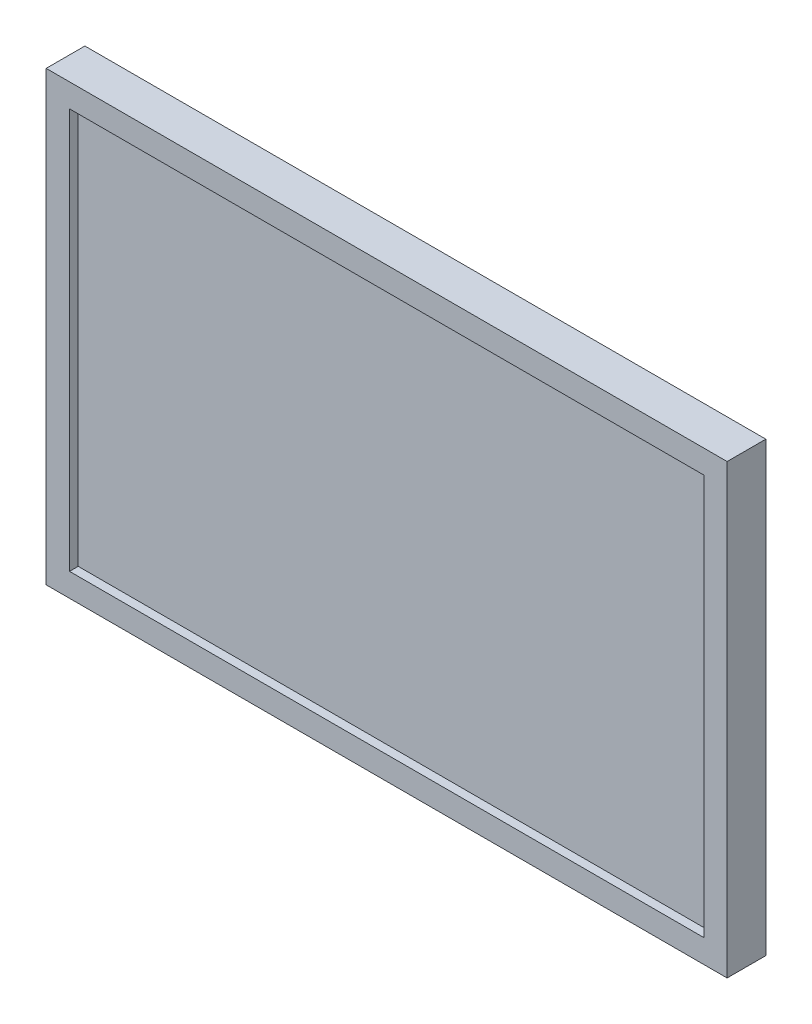
ISO-10303-21;
HEADER;
FILE_DESCRIPTION(('STEP AP214'),'2;1');
FILE_NAME('part.step','',(''),(''),'','','');
FILE_SCHEMA(('AUTOMOTIVE_DESIGN { 1 0 10303 214 1 1 1 1 }'));
ENDSEC;
DATA;
#1=APPLICATION_CONTEXT('core data for automotive mechanical design processes');
#2=APPLICATION_PROTOCOL_DEFINITION('international standard','automotive_design',2000,#1);
#3=PRODUCT_CONTEXT('',#1,'mechanical');
#4=PRODUCT('Part','Part','',(#3));
#5=PRODUCT_RELATED_PRODUCT_CATEGORY('part','',(#4));
#6=PRODUCT_DEFINITION_FORMATION('','',#4);
#7=PRODUCT_DEFINITION_CONTEXT('part definition',#1,'design');
#8=PRODUCT_DEFINITION('design','',#6,#7);
#9=PRODUCT_DEFINITION_SHAPE('','',#8);
#10=(LENGTH_UNIT() NAMED_UNIT(*) SI_UNIT(.MILLI.,.METRE.));
#11=(NAMED_UNIT(*) PLANE_ANGLE_UNIT() SI_UNIT($,.RADIAN.));
#12=(NAMED_UNIT(*) SI_UNIT($,.STERADIAN.) SOLID_ANGLE_UNIT());
#13=UNCERTAINTY_MEASURE_WITH_UNIT(LENGTH_MEASURE(1.E-05),#10,'distance_accuracy_value','');
#14=(GEOMETRIC_REPRESENTATION_CONTEXT(3) GLOBAL_UNCERTAINTY_ASSIGNED_CONTEXT((#13)) GLOBAL_UNIT_ASSIGNED_CONTEXT((#10,
#11,#12)) REPRESENTATION_CONTEXT('',''));
#15=CARTESIAN_POINT('',(0.,0.,0.));
#16=DIRECTION('',(0.,0.,1.));
#17=DIRECTION('',(1.,0.,0.));
#18=AXIS2_PLACEMENT_3D('',#15,#16,#17);
#19=CARTESIAN_POINT('',(0.,0.,-29.));
#20=DIRECTION('',(0.,0.,-1.));
#21=DIRECTION('',(-1.,0.,0.));
#22=AXIS2_PLACEMENT_3D('',#19,#20,#21);
#23=PLANE('',#22);
#24=DIRECTION('',(-1.,0.,0.));
#25=VECTOR('',#24,1.);
#26=CARTESIAN_POINT('',(125.,80.5,-29.));
#27=LINE('',#26,#25);
#28=CARTESIAN_POINT('',(125.,80.5,-29.));
#29=VERTEX_POINT('',#28);
#30=CARTESIAN_POINT('',(-125.,80.5,-29.));
#31=VERTEX_POINT('',#30);
#32=EDGE_CURVE('E229',#29,#31,#27,.T.);
#33=ORIENTED_EDGE('',*,*,#32,.T.);
#34=DIRECTION('',(0.831065477040289,-0.556174588480809,0.));
#35=VECTOR('',#34,1.);
#36=CARTESIAN_POINT('',(-125.,80.5,-29.));
#37=LINE('',#36,#35);
#38=CARTESIAN_POINT('',(-255.,167.5,-29.));
#39=VERTEX_POINT('',#38);
#40=EDGE_CURVE('E293',#39,#31,#37,.T.);
#41=ORIENTED_EDGE('',*,*,#40,.F.);
#42=DIRECTION('',(-1.,0.,0.));
#43=VECTOR('',#42,1.);
#44=CARTESIAN_POINT('',(-255.,167.5,-29.));
#45=LINE('',#44,#43);
#46=CARTESIAN_POINT('',(255.,167.5,-29.));
#47=VERTEX_POINT('',#46);
#48=EDGE_CURVE('E117',#47,#39,#45,.T.);
#49=ORIENTED_EDGE('',*,*,#48,.F.);
#50=DIRECTION('',(-0.831065477040289,-0.556174588480809,0.));
#51=VECTOR('',#50,1.);
#52=CARTESIAN_POINT('',(125.,80.5,-29.));
#53=LINE('',#52,#51);
#54=EDGE_CURVE('E66',#47,#29,#53,.T.);
#55=ORIENTED_EDGE('',*,*,#54,.T.);
#56=EDGE_LOOP('',(#33,#41,#49,#55));
#57=FACE_BOUND('',#56,.T.);
#58=ADVANCED_FACE('F39',(#57),#23,.T.);
#59=CARTESIAN_POINT('',(125.,80.5,264.625611961899));
#60=DIRECTION('',(0.,1.,0.));
#61=DIRECTION('',(-1.,0.,0.));
#62=AXIS2_PLACEMENT_3D('',#59,#60,#61);
#63=PLANE('',#62);
#64=DIRECTION('',(0.,0.,-1.));
#65=VECTOR('',#64,1.);
#66=CARTESIAN_POINT('',(125.,80.5,240.432737431812));
#67=LINE('',#66,#65);
#68=CARTESIAN_POINT('',(125.,80.5,-92.));
#69=VERTEX_POINT('',#68);
#70=EDGE_CURVE('E307',#29,#69,#67,.T.);
#71=ORIENTED_EDGE('',*,*,#70,.T.);
#72=DIRECTION('',(1.,0.,0.));
#73=VECTOR('',#72,1.);
#74=CARTESIAN_POINT('',(125.,80.5,-92.));
#75=LINE('',#74,#73);
#76=CARTESIAN_POINT('',(-125.,80.5,-92.));
#77=VERTEX_POINT('',#76);
#78=EDGE_CURVE('E257',#77,#69,#75,.T.);
#79=ORIENTED_EDGE('',*,*,#78,.F.);
#80=DIRECTION('',(0.,0.,-1.));
#81=VECTOR('',#80,1.);
#82=CARTESIAN_POINT('',(-125.,80.5,240.432737431812));
#83=LINE('',#82,#81);
#84=EDGE_CURVE('E297',#31,#77,#83,.T.);
#85=ORIENTED_EDGE('',*,*,#84,.F.);
#86=ORIENTED_EDGE('',*,*,#32,.F.);
#87=EDGE_LOOP('',(#71,#79,#85,#86));
#88=FACE_BOUND('',#87,.T.);
#89=ADVANCED_FACE('F412',(#88),#63,.T.);
#90=CARTESIAN_POINT('',(255.,-167.5,-29.));
#91=DIRECTION('',(1.,0.,0.));
#92=DIRECTION('',(0.,0.,-1.));
#93=AXIS2_PLACEMENT_3D('',#90,#91,#92);
#94=PLANE('',#93);
#95=DIRECTION('',(0.,1.,0.));
#96=VECTOR('',#95,1.);
#97=CARTESIAN_POINT('',(255.,-167.5,0.));
#98=LINE('',#97,#96);
#99=CARTESIAN_POINT('',(255.,-167.5,0.));
#100=VERTEX_POINT('',#99);
#101=CARTESIAN_POINT('',(255.,167.5,0.));
#102=VERTEX_POINT('',#101);
#103=EDGE_CURVE('E134',#100,#102,#98,.T.);
#104=ORIENTED_EDGE('',*,*,#103,.F.);
#105=DIRECTION('',(0.,0.,1.));
#106=VECTOR('',#105,1.);
#107=CARTESIAN_POINT('',(255.,-167.5,-29.));
#108=LINE('',#107,#106);
#109=CARTESIAN_POINT('',(255.,-167.5,-29.));
#110=VERTEX_POINT('',#109);
#111=EDGE_CURVE('E11',#110,#100,#108,.T.);
#112=ORIENTED_EDGE('',*,*,#111,.F.);
#113=DIRECTION('',(0.,1.,0.));
#114=VECTOR('',#113,1.);
#115=CARTESIAN_POINT('',(255.,-167.5,-29.));
#116=LINE('',#115,#114);
#117=EDGE_CURVE('E113',#110,#47,#116,.T.);
#118=ORIENTED_EDGE('',*,*,#117,.T.);
#119=DIRECTION('',(0.,0.,1.));
#120=VECTOR('',#119,1.);
#121=CARTESIAN_POINT('',(255.,167.5,-29.));
#122=LINE('',#121,#120);
#123=EDGE_CURVE('E43',#47,#102,#122,.T.);
#124=ORIENTED_EDGE('',*,*,#123,.T.);
#125=EDGE_LOOP('',(#104,#112,#118,#124));
#126=FACE_BOUND('',#125,.T.);
#127=ADVANCED_FACE('F41',(#126),#94,.T.);
#128=CARTESIAN_POINT('',(-255.,-167.5,-29.));
#129=DIRECTION('',(0.,-1.,0.));
#130=DIRECTION('',(0.,0.,-1.));
#131=AXIS2_PLACEMENT_3D('',#128,#129,#130);
#132=PLANE('',#131);
#133=DIRECTION('',(1.,0.,0.));
#134=VECTOR('',#133,1.);
#135=CARTESIAN_POINT('',(-255.,-167.5,0.));
#136=LINE('',#135,#134);
#137=CARTESIAN_POINT('',(-255.,-167.5,0.));
#138=VERTEX_POINT('',#137);
#139=EDGE_CURVE('E104',#138,#100,#136,.T.);
#140=ORIENTED_EDGE('',*,*,#139,.F.);
#141=DIRECTION('',(0.,0.,1.));
#142=VECTOR('',#141,1.);
#143=CARTESIAN_POINT('',(-255.,-167.5,-29.));
#144=LINE('',#143,#142);
#145=CARTESIAN_POINT('',(-255.,-167.5,-29.));
#146=VERTEX_POINT('',#145);
#147=EDGE_CURVE('E49',#146,#138,#144,.T.);
#148=ORIENTED_EDGE('',*,*,#147,.F.);
#149=DIRECTION('',(1.,0.,0.));
#150=VECTOR('',#149,1.);
#151=CARTESIAN_POINT('',(-255.,-167.5,-29.));
#152=LINE('',#151,#150);
#153=EDGE_CURVE('E124',#146,#110,#152,.T.);
#154=ORIENTED_EDGE('',*,*,#153,.T.);
#155=ORIENTED_EDGE('',*,*,#111,.T.);
#156=EDGE_LOOP('',(#140,#148,#154,#155));
#157=FACE_BOUND('',#156,.T.);
#158=ADVANCED_FACE('F109',(#157),#132,.T.);
#159=CARTESIAN_POINT('',(-255.,-167.5,-29.));
#160=DIRECTION('',(-1.,0.,0.));
#161=DIRECTION('',(0.,0.,1.));
#162=AXIS2_PLACEMENT_3D('',#159,#160,#161);
#163=PLANE('',#162);
#164=DIRECTION('',(0.,-1.,0.));
#165=VECTOR('',#164,1.);
#166=CARTESIAN_POINT('',(-255.,-167.5,0.));
#167=LINE('',#166,#165);
#168=CARTESIAN_POINT('',(-255.,167.5,0.));
#169=VERTEX_POINT('',#168);
#170=EDGE_CURVE('E88',#169,#138,#167,.T.);
#171=ORIENTED_EDGE('',*,*,#170,.F.);
#172=DIRECTION('',(0.,0.,1.));
#173=VECTOR('',#172,1.);
#174=CARTESIAN_POINT('',(-255.,167.5,-29.));
#175=LINE('',#174,#173);
#176=EDGE_CURVE('E98',#39,#169,#175,.T.);
#177=ORIENTED_EDGE('',*,*,#176,.F.);
#178=DIRECTION('',(0.,-1.,0.));
#179=VECTOR('',#178,1.);
#180=CARTESIAN_POINT('',(-255.,-167.5,-29.));
#181=LINE('',#180,#179);
#182=EDGE_CURVE('E92',#39,#146,#181,.T.);
#183=ORIENTED_EDGE('',*,*,#182,.T.);
#184=ORIENTED_EDGE('',*,*,#147,.T.);
#185=EDGE_LOOP('',(#171,#177,#183,#184));
#186=FACE_BOUND('',#185,.T.);
#187=ADVANCED_FACE('F86',(#186),#163,.T.);
#188=CARTESIAN_POINT('',(-255.,167.5,-29.));
#189=DIRECTION('',(0.,1.,0.));
#190=DIRECTION('',(0.,0.,1.));
#191=AXIS2_PLACEMENT_3D('',#188,#189,#190);
#192=PLANE('',#191);
#193=DIRECTION('',(-1.,0.,0.));
#194=VECTOR('',#193,1.);
#195=CARTESIAN_POINT('',(-255.,167.5,0.));
#196=LINE('',#195,#194);
#197=EDGE_CURVE('E106',#102,#169,#196,.T.);
#198=ORIENTED_EDGE('',*,*,#197,.F.);
#199=ORIENTED_EDGE('',*,*,#123,.F.);
#200=ORIENTED_EDGE('',*,*,#48,.T.);
#201=ORIENTED_EDGE('',*,*,#176,.T.);
#202=EDGE_LOOP('',(#198,#199,#200,#201));
#203=FACE_BOUND('',#202,.T.);
#204=ADVANCED_FACE('F319',(#203),#192,.T.);
#205=CARTESIAN_POINT('',(0.,0.,0.));
#206=DIRECTION('',(0.,0.,-1.));
#207=DIRECTION('',(-1.,0.,0.));
#208=AXIS2_PLACEMENT_3D('',#205,#206,#207);
#209=PLANE('',#208);
#210=DIRECTION('',(1.,0.,0.));
#211=VECTOR('',#210,1.);
#212=CARTESIAN_POINT('',(237.5,-150.,0.));
#213=LINE('',#212,#211);
#214=CARTESIAN_POINT('',(-237.5,-150.,0.));
#215=VERTEX_POINT('',#214);
#216=CARTESIAN_POINT('',(237.5,-150.,0.));
#217=VERTEX_POINT('',#216);
#218=EDGE_CURVE('E175',#215,#217,#213,.T.);
#219=ORIENTED_EDGE('',*,*,#218,.F.);
#220=DIRECTION('',(0.,-1.,0.));
#221=VECTOR('',#220,1.);
#222=CARTESIAN_POINT('',(-237.5,-150.,0.));
#223=LINE('',#222,#221);
#224=CARTESIAN_POINT('',(-237.5,150.,0.));
#225=VERTEX_POINT('',#224);
#226=EDGE_CURVE('E57',#225,#215,#223,.T.);
#227=ORIENTED_EDGE('',*,*,#226,.F.);
#228=DIRECTION('',(-1.,0.,0.));
#229=VECTOR('',#228,1.);
#230=CARTESIAN_POINT('',(237.5,150.,0.));
#231=LINE('',#230,#229);
#232=CARTESIAN_POINT('',(237.5,150.,0.));
#233=VERTEX_POINT('',#232);
#234=EDGE_CURVE('E167',#233,#225,#231,.T.);
#235=ORIENTED_EDGE('',*,*,#234,.F.);
#236=DIRECTION('',(0.,1.,0.));
#237=VECTOR('',#236,1.);
#238=CARTESIAN_POINT('',(237.5,-150.,0.));
#239=LINE('',#238,#237);
#240=EDGE_CURVE('E171',#217,#233,#239,.T.);
#241=ORIENTED_EDGE('',*,*,#240,.F.);
#242=EDGE_LOOP('',(#219,#227,#235,#241));
#243=FACE_BOUND('',#242,.T.);
#244=ORIENTED_EDGE('',*,*,#103,.T.);
#245=ORIENTED_EDGE('',*,*,#197,.T.);
#246=ORIENTED_EDGE('',*,*,#170,.T.);
#247=ORIENTED_EDGE('',*,*,#139,.T.);
#248=EDGE_LOOP('',(#244,#245,#246,#247));
#249=FACE_BOUND('',#248,.T.);
#250=ADVANCED_FACE('F103',(#243,#249),#209,.F.);
#251=CARTESIAN_POINT('',(-237.5,-150.,-6.5));
#252=DIRECTION('',(-1.,0.,0.));
#253=DIRECTION('',(0.,0.,1.));
#254=AXIS2_PLACEMENT_3D('',#251,#252,#253);
#255=PLANE('',#254);
#256=ORIENTED_EDGE('',*,*,#226,.T.);
#257=DIRECTION('',(0.,0.,1.));
#258=VECTOR('',#257,1.);
#259=CARTESIAN_POINT('',(-237.5,-150.,-6.5));
#260=LINE('',#259,#258);
#261=CARTESIAN_POINT('',(-237.5,-150.,-6.5));
#262=VERTEX_POINT('',#261);
#263=EDGE_CURVE('E148',#262,#215,#260,.T.);
#264=ORIENTED_EDGE('',*,*,#263,.F.);
#265=DIRECTION('',(0.,-1.,0.));
#266=VECTOR('',#265,1.);
#267=CARTESIAN_POINT('',(-237.5,-150.,-6.5));
#268=LINE('',#267,#266);
#269=CARTESIAN_POINT('',(-237.5,150.,-6.5));
#270=VERTEX_POINT('',#269);
#271=EDGE_CURVE('E163',#270,#262,#268,.T.);
#272=ORIENTED_EDGE('',*,*,#271,.F.);
#273=DIRECTION('',(0.,0.,1.));
#274=VECTOR('',#273,1.);
#275=CARTESIAN_POINT('',(-237.5,150.,-6.5));
#276=LINE('',#275,#274);
#277=EDGE_CURVE('E136',#270,#225,#276,.T.);
#278=ORIENTED_EDGE('',*,*,#277,.T.);
#279=EDGE_LOOP('',(#256,#264,#272,#278));
#280=FACE_BOUND('',#279,.T.);
#281=ADVANCED_FACE('F389',(#280),#255,.F.);
#282=CARTESIAN_POINT('',(237.5,150.,-6.5));
#283=DIRECTION('',(0.,1.,0.));
#284=DIRECTION('',(-1.,0.,0.));
#285=AXIS2_PLACEMENT_3D('',#282,#283,#284);
#286=PLANE('',#285);
#287=ORIENTED_EDGE('',*,*,#234,.T.);
#288=ORIENTED_EDGE('',*,*,#277,.F.);
#289=DIRECTION('',(-1.,0.,0.));
#290=VECTOR('',#289,1.);
#291=CARTESIAN_POINT('',(237.5,150.,-6.5));
#292=LINE('',#291,#290);
#293=CARTESIAN_POINT('',(237.5,150.,-6.5));
#294=VERTEX_POINT('',#293);
#295=EDGE_CURVE('E151',#294,#270,#292,.T.);
#296=ORIENTED_EDGE('',*,*,#295,.F.);
#297=DIRECTION('',(0.,0.,1.));
#298=VECTOR('',#297,1.);
#299=CARTESIAN_POINT('',(237.5,150.,-6.5));
#300=LINE('',#299,#298);
#301=EDGE_CURVE('E140',#294,#233,#300,.T.);
#302=ORIENTED_EDGE('',*,*,#301,.T.);
#303=EDGE_LOOP('',(#287,#288,#296,#302));
#304=FACE_BOUND('',#303,.T.);
#305=ADVANCED_FACE('F391',(#304),#286,.F.);
#306=CARTESIAN_POINT('',(237.5,-150.,-6.5));
#307=DIRECTION('',(1.,0.,0.));
#308=DIRECTION('',(0.,0.,-1.));
#309=AXIS2_PLACEMENT_3D('',#306,#307,#308);
#310=PLANE('',#309);
#311=ORIENTED_EDGE('',*,*,#240,.T.);
#312=ORIENTED_EDGE('',*,*,#301,.F.);
#313=DIRECTION('',(0.,1.,0.));
#314=VECTOR('',#313,1.);
#315=CARTESIAN_POINT('',(237.5,-150.,-6.5));
#316=LINE('',#315,#314);
#317=CARTESIAN_POINT('',(237.5,-150.,-6.5));
#318=VERTEX_POINT('',#317);
#319=EDGE_CURVE('E155',#318,#294,#316,.T.);
#320=ORIENTED_EDGE('',*,*,#319,.F.);
#321=DIRECTION('',(0.,0.,1.));
#322=VECTOR('',#321,1.);
#323=CARTESIAN_POINT('',(237.5,-150.,-6.5));
#324=LINE('',#323,#322);
#325=EDGE_CURVE('E144',#318,#217,#324,.T.);
#326=ORIENTED_EDGE('',*,*,#325,.T.);
#327=EDGE_LOOP('',(#311,#312,#320,#326));
#328=FACE_BOUND('',#327,.T.);
#329=ADVANCED_FACE('F402',(#328),#310,.F.);
#330=CARTESIAN_POINT('',(237.5,-150.,-6.5));
#331=DIRECTION('',(0.,-1.,0.));
#332=DIRECTION('',(1.,0.,0.));
#333=AXIS2_PLACEMENT_3D('',#330,#331,#332);
#334=PLANE('',#333);
#335=ORIENTED_EDGE('',*,*,#218,.T.);
#336=ORIENTED_EDGE('',*,*,#325,.F.);
#337=DIRECTION('',(1.,0.,0.));
#338=VECTOR('',#337,1.);
#339=CARTESIAN_POINT('',(237.5,-150.,-6.5));
#340=LINE('',#339,#338);
#341=EDGE_CURVE('E159',#262,#318,#340,.T.);
#342=ORIENTED_EDGE('',*,*,#341,.F.);
#343=ORIENTED_EDGE('',*,*,#263,.T.);
#344=EDGE_LOOP('',(#335,#336,#342,#343));
#345=FACE_BOUND('',#344,.T.);
#346=ADVANCED_FACE('F396',(#345),#334,.F.);
#347=CARTESIAN_POINT('',(0.,0.,-6.5));
#348=DIRECTION('',(0.,0.,1.));
#349=DIRECTION('',(1.,0.,0.));
#350=AXIS2_PLACEMENT_3D('',#347,#348,#349);
#351=PLANE('',#350);
#352=ORIENTED_EDGE('',*,*,#271,.T.);
#353=ORIENTED_EDGE('',*,*,#341,.T.);
#354=ORIENTED_EDGE('',*,*,#319,.T.);
#355=ORIENTED_EDGE('',*,*,#295,.T.);
#356=EDGE_LOOP('',(#352,#353,#354,#355));
#357=FACE_BOUND('',#356,.T.);
#358=ADVANCED_FACE('F400',(#357),#351,.T.);
#359=CARTESIAN_POINT('',(61.,-60.4999999999999,264.625611961899));
#360=DIRECTION('',(0.,-1.,0.));
#361=DIRECTION('',(0.,0.,-1.));
#362=AXIS2_PLACEMENT_3D('',#359,#360,#361);
#363=PLANE('',#362);
#364=DIRECTION('',(0.,0.,-1.));
#365=VECTOR('',#364,1.);
#366=CARTESIAN_POINT('',(-61.,-60.4999999999999,264.625611961899));
#367=LINE('',#366,#365);
#368=CARTESIAN_POINT('',(-61.,-60.4999999999999,-85.));
#369=VERTEX_POINT('',#368);
#370=CARTESIAN_POINT('',(-61.,-60.4999999999999,-92.));
#371=VERTEX_POINT('',#370);
#372=EDGE_CURVE('E241',#369,#371,#367,.T.);
#373=ORIENTED_EDGE('',*,*,#372,.F.);
#374=DIRECTION('',(-1.,0.,0.));
#375=VECTOR('',#374,1.);
#376=CARTESIAN_POINT('',(61.,-60.4999999999999,-85.));
#377=LINE('',#376,#375);
#378=CARTESIAN_POINT('',(61.,-60.4999999999999,-85.));
#379=VERTEX_POINT('',#378);
#380=EDGE_CURVE('E181',#379,#369,#377,.T.);
#381=ORIENTED_EDGE('',*,*,#380,.F.);
#382=DIRECTION('',(0.,0.,-1.));
#383=VECTOR('',#382,1.);
#384=CARTESIAN_POINT('',(61.,-60.4999999999999,264.625611961899));
#385=LINE('',#384,#383);
#386=CARTESIAN_POINT('',(61.,-60.4999999999999,-92.));
#387=VERTEX_POINT('',#386);
#388=EDGE_CURVE('E245',#379,#387,#385,.T.);
#389=ORIENTED_EDGE('',*,*,#388,.T.);
#390=DIRECTION('',(-1.,0.,0.));
#391=VECTOR('',#390,1.);
#392=CARTESIAN_POINT('',(61.,-60.4999999999999,-92.));
#393=LINE('',#392,#391);
#394=EDGE_CURVE('E273',#387,#371,#393,.T.);
#395=ORIENTED_EDGE('',*,*,#394,.T.);
#396=EDGE_LOOP('',(#373,#381,#389,#395));
#397=FACE_BOUND('',#396,.T.);
#398=ADVANCED_FACE('F543',(#397),#363,.F.);
#399=CARTESIAN_POINT('',(-61.,-60.4999999999999,264.625611961899));
#400=DIRECTION('',(-1.,0.,0.));
#401=DIRECTION('',(0.,0.,1.));
#402=AXIS2_PLACEMENT_3D('',#399,#400,#401);
#403=PLANE('',#402);
#404=DIRECTION('',(0.,0.,-1.));
#405=VECTOR('',#404,1.);
#406=CARTESIAN_POINT('',(-61.,61.5000000000001,264.625611961899));
#407=LINE('',#406,#405);
#408=CARTESIAN_POINT('',(-61.,61.5000000000001,-85.));
#409=VERTEX_POINT('',#408);
#410=CARTESIAN_POINT('',(-61.,61.5000000000001,-92.));
#411=VERTEX_POINT('',#410);
#412=EDGE_CURVE('E237',#409,#411,#407,.T.);
#413=ORIENTED_EDGE('',*,*,#412,.F.);
#414=DIRECTION('',(0.,1.,0.));
#415=VECTOR('',#414,1.);
#416=CARTESIAN_POINT('',(-61.,-60.4999999999999,-85.));
#417=LINE('',#416,#415);
#418=EDGE_CURVE('E193',#369,#409,#417,.T.);
#419=ORIENTED_EDGE('',*,*,#418,.F.);
#420=ORIENTED_EDGE('',*,*,#372,.T.);
#421=DIRECTION('',(0.,1.,0.));
#422=VECTOR('',#421,1.);
#423=CARTESIAN_POINT('',(-61.,-60.4999999999999,-92.));
#424=LINE('',#423,#422);
#425=EDGE_CURVE('E269',#371,#411,#424,.T.);
#426=ORIENTED_EDGE('',*,*,#425,.T.);
#427=EDGE_LOOP('',(#413,#419,#420,#426));
#428=FACE_BOUND('',#427,.T.);
#429=ADVANCED_FACE('F533',(#428),#403,.F.);
#430=CARTESIAN_POINT('',(-61.,61.5000000000001,264.625611961899));
#431=DIRECTION('',(0.,1.,0.));
#432=DIRECTION('',(0.,0.,1.));
#433=AXIS2_PLACEMENT_3D('',#430,#431,#432);
#434=PLANE('',#433);
#435=DIRECTION('',(0.,0.,-1.));
#436=VECTOR('',#435,1.);
#437=CARTESIAN_POINT('',(61.0000000000001,61.5000000000001,264.625611961899));
#438=LINE('',#437,#436);
#439=CARTESIAN_POINT('',(61.0000000000001,61.5000000000001,-85.));
#440=VERTEX_POINT('',#439);
#441=CARTESIAN_POINT('',(61.0000000000001,61.5000000000001,-92.));
#442=VERTEX_POINT('',#441);
#443=EDGE_CURVE('E233',#440,#442,#438,.T.);
#444=ORIENTED_EDGE('',*,*,#443,.F.);
#445=DIRECTION('',(1.,0.,0.));
#446=VECTOR('',#445,1.);
#447=CARTESIAN_POINT('',(61.0000000000001,61.5000000000001,-85.));
#448=LINE('',#447,#446);
#449=EDGE_CURVE('E189',#409,#440,#448,.T.);
#450=ORIENTED_EDGE('',*,*,#449,.F.);
#451=ORIENTED_EDGE('',*,*,#412,.T.);
#452=DIRECTION('',(1.,0.,0.));
#453=VECTOR('',#452,1.);
#454=CARTESIAN_POINT('',(-61.,61.5000000000001,-92.));
#455=LINE('',#454,#453);
#456=EDGE_CURVE('E265',#411,#442,#455,.T.);
#457=ORIENTED_EDGE('',*,*,#456,.T.);
#458=EDGE_LOOP('',(#444,#450,#451,#457));
#459=FACE_BOUND('',#458,.T.);
#460=ADVANCED_FACE('F523',(#459),#434,.F.);
#461=CARTESIAN_POINT('',(61.0000000000001,61.5000000000001,264.625611961899));
#462=DIRECTION('',(1.,0.,0.));
#463=DIRECTION('',(0.,1.,0.));
#464=AXIS2_PLACEMENT_3D('',#461,#462,#463);
#465=PLANE('',#464);
#466=ORIENTED_EDGE('',*,*,#388,.F.);
#467=DIRECTION('',(0.,-1.,0.));
#468=VECTOR('',#467,1.);
#469=CARTESIAN_POINT('',(61.,-60.4999999999999,-85.));
#470=LINE('',#469,#468);
#471=EDGE_CURVE('E185',#440,#379,#470,.T.);
#472=ORIENTED_EDGE('',*,*,#471,.F.);
#473=ORIENTED_EDGE('',*,*,#443,.T.);
#474=DIRECTION('',(0.,-1.,0.));
#475=VECTOR('',#474,1.);
#476=CARTESIAN_POINT('',(61.0000000000001,61.5000000000001,-92.));
#477=LINE('',#476,#475);
#478=EDGE_CURVE('E277',#442,#387,#477,.T.);
#479=ORIENTED_EDGE('',*,*,#478,.T.);
#480=EDGE_LOOP('',(#466,#472,#473,#479));
#481=FACE_BOUND('',#480,.T.);
#482=ADVANCED_FACE('F440',(#481),#465,.F.);
#483=CARTESIAN_POINT('',(0.,0.,-92.));
#484=DIRECTION('',(0.,0.,1.));
#485=DIRECTION('',(1.,0.,0.));
#486=AXIS2_PLACEMENT_3D('',#483,#484,#485);
#487=PLANE('',#486);
#488=DIRECTION('',(0.,1.,0.));
#489=VECTOR('',#488,1.);
#490=CARTESIAN_POINT('',(-125.,-73.4999999999999,-92.));
#491=LINE('',#490,#489);
#492=CARTESIAN_POINT('',(-125.,-73.4999999999999,-92.));
#493=VERTEX_POINT('',#492);
#494=EDGE_CURVE('E261',#493,#77,#491,.T.);
#495=ORIENTED_EDGE('',*,*,#494,.T.);
#496=ORIENTED_EDGE('',*,*,#78,.T.);
#497=DIRECTION('',(0.,-1.,0.));
#498=VECTOR('',#497,1.);
#499=CARTESIAN_POINT('',(125.,-73.4999999999999,-92.));
#500=LINE('',#499,#498);
#501=CARTESIAN_POINT('',(125.,-73.4999999999999,-92.));
#502=VERTEX_POINT('',#501);
#503=EDGE_CURVE('E253',#69,#502,#500,.T.);
#504=ORIENTED_EDGE('',*,*,#503,.T.);
#505=DIRECTION('',(-1.,0.,0.));
#506=VECTOR('',#505,1.);
#507=CARTESIAN_POINT('',(125.,-73.4999999999999,-92.));
#508=LINE('',#507,#506);
#509=EDGE_CURVE('E249',#502,#493,#508,.T.);
#510=ORIENTED_EDGE('',*,*,#509,.T.);
#511=EDGE_LOOP('',(#495,#496,#504,#510));
#512=FACE_BOUND('',#511,.T.);
#513=ORIENTED_EDGE('',*,*,#478,.F.);
#514=ORIENTED_EDGE('',*,*,#456,.F.);
#515=ORIENTED_EDGE('',*,*,#425,.F.);
#516=ORIENTED_EDGE('',*,*,#394,.F.);
#517=EDGE_LOOP('',(#513,#514,#515,#516));
#518=FACE_BOUND('',#517,.T.);
#519=ADVANCED_FACE('F343',(#512,#518),#487,.F.);
#520=CARTESIAN_POINT('',(50.,50.,-75.));
#521=DIRECTION('',(0.,0.,-1.));
#522=DIRECTION('',(-1.,0.,0.));
#523=AXIS2_PLACEMENT_3D('',#520,#521,#522);
#524=PLANE('',#523);
#525=CARTESIAN_POINT('',(50.,50.,-75.));
#526=DIRECTION('',(0.,0.,-1.));
#527=DIRECTION('',(-1.,0.,0.));
#528=AXIS2_PLACEMENT_3D('',#525,#526,#527);
#529=CIRCLE('',#528,2.);
#530=CARTESIAN_POINT('',(48.,50.,-75.));
#531=VERTEX_POINT('',#530);
#532=EDGE_CURVE('E197',#531,#531,#529,.T.);
#533=ORIENTED_EDGE('',*,*,#532,.T.);
#534=EDGE_LOOP('',(#533));
#535=FACE_BOUND('',#534,.T.);
#536=ADVANCED_FACE('F439',(#535),#524,.T.);
#537=CARTESIAN_POINT('',(-50.,50.,-75.));
#538=DIRECTION('',(0.,0.,-1.));
#539=DIRECTION('',(-1.,0.,0.));
#540=AXIS2_PLACEMENT_3D('',#537,#538,#539);
#541=PLANE('',#540);
#542=CARTESIAN_POINT('',(-50.,50.,-75.));
#543=DIRECTION('',(0.,0.,-1.));
#544=DIRECTION('',(-1.,0.,0.));
#545=AXIS2_PLACEMENT_3D('',#542,#543,#544);
#546=CIRCLE('',#545,2.);
#547=CARTESIAN_POINT('',(-52.,50.,-75.));
#548=VERTEX_POINT('',#547);
#549=EDGE_CURVE('E205',#548,#548,#546,.T.);
#550=ORIENTED_EDGE('',*,*,#549,.T.);
#551=EDGE_LOOP('',(#550));
#552=FACE_BOUND('',#551,.T.);
#553=ADVANCED_FACE('F586',(#552),#541,.T.);
#554=CARTESIAN_POINT('',(-50.,-50.,-75.));
#555=DIRECTION('',(0.,0.,-1.));
#556=DIRECTION('',(-1.,0.,0.));
#557=AXIS2_PLACEMENT_3D('',#554,#555,#556);
#558=PLANE('',#557);
#559=CARTESIAN_POINT('',(-50.,-50.,-75.));
#560=DIRECTION('',(0.,0.,-1.));
#561=DIRECTION('',(-1.,0.,0.));
#562=AXIS2_PLACEMENT_3D('',#559,#560,#561);
#563=CIRCLE('',#562,2.);
#564=CARTESIAN_POINT('',(-52.,-50.,-75.));
#565=VERTEX_POINT('',#564);
#566=EDGE_CURVE('E213',#565,#565,#563,.T.);
#567=ORIENTED_EDGE('',*,*,#566,.T.);
#568=EDGE_LOOP('',(#567));
#569=FACE_BOUND('',#568,.T.);
#570=ADVANCED_FACE('F565',(#569),#558,.T.);
#571=CARTESIAN_POINT('',(50.,-50.,-75.));
#572=DIRECTION('',(0.,0.,-1.));
#573=DIRECTION('',(-1.,0.,0.));
#574=AXIS2_PLACEMENT_3D('',#571,#572,#573);
#575=PLANE('',#574);
#576=CARTESIAN_POINT('',(50.,-50.,-75.));
#577=DIRECTION('',(0.,0.,-1.));
#578=DIRECTION('',(-1.,0.,0.));
#579=AXIS2_PLACEMENT_3D('',#576,#577,#578);
#580=CIRCLE('',#579,2.);
#581=CARTESIAN_POINT('',(48.,-50.,-75.));
#582=VERTEX_POINT('',#581);
#583=EDGE_CURVE('E221',#582,#582,#580,.T.);
#584=ORIENTED_EDGE('',*,*,#583,.T.);
#585=EDGE_LOOP('',(#584));
#586=FACE_BOUND('',#585,.T.);
#587=ADVANCED_FACE('F560',(#586),#575,.T.);
#588=CARTESIAN_POINT('',(50.,50.,-75.));
#589=DIRECTION('',(0.,0.,-1.));
#590=DIRECTION('',(-1.,0.,0.));
#591=AXIS2_PLACEMENT_3D('',#588,#589,#590);
#592=CYLINDRICAL_SURFACE('',#591,2.);
#593=ORIENTED_EDGE('',*,*,#532,.F.);
#594=EDGE_LOOP('',(#593));
#595=FACE_BOUND('',#594,.T.);
#596=CARTESIAN_POINT('',(50.,50.,-85.));
#597=DIRECTION('',(0.,0.,-1.));
#598=DIRECTION('',(-1.,0.,0.));
#599=AXIS2_PLACEMENT_3D('',#596,#597,#598);
#600=CIRCLE('',#599,2.);
#601=CARTESIAN_POINT('',(48.,50.,-85.));
#602=VERTEX_POINT('',#601);
#603=EDGE_CURVE('E201',#602,#602,#600,.T.);
#604=ORIENTED_EDGE('',*,*,#603,.T.);
#605=EDGE_LOOP('',(#604));
#606=FACE_BOUND('',#605,.T.);
#607=ADVANCED_FACE('F564',(#595,#606),#592,.F.);
#608=CARTESIAN_POINT('',(-50.,50.,-75.));
#609=DIRECTION('',(0.,0.,-1.));
#610=DIRECTION('',(-1.,0.,0.));
#611=AXIS2_PLACEMENT_3D('',#608,#609,#610);
#612=CYLINDRICAL_SURFACE('',#611,2.);
#613=ORIENTED_EDGE('',*,*,#549,.F.);
#614=EDGE_LOOP('',(#613));
#615=FACE_BOUND('',#614,.T.);
#616=CARTESIAN_POINT('',(-50.,50.,-85.));
#617=DIRECTION('',(0.,0.,-1.));
#618=DIRECTION('',(-1.,0.,0.));
#619=AXIS2_PLACEMENT_3D('',#616,#617,#618);
#620=CIRCLE('',#619,2.);
#621=CARTESIAN_POINT('',(-52.,50.,-85.));
#622=VERTEX_POINT('',#621);
#623=EDGE_CURVE('E209',#622,#622,#620,.T.);
#624=ORIENTED_EDGE('',*,*,#623,.T.);
#625=EDGE_LOOP('',(#624));
#626=FACE_BOUND('',#625,.T.);
#627=ADVANCED_FACE('F596',(#615,#626),#612,.F.);
#628=CARTESIAN_POINT('',(-50.,-50.,-75.));
#629=DIRECTION('',(0.,0.,-1.));
#630=DIRECTION('',(-1.,0.,0.));
#631=AXIS2_PLACEMENT_3D('',#628,#629,#630);
#632=CYLINDRICAL_SURFACE('',#631,2.);
#633=ORIENTED_EDGE('',*,*,#566,.F.);
#634=EDGE_LOOP('',(#633));
#635=FACE_BOUND('',#634,.T.);
#636=CARTESIAN_POINT('',(-50.,-50.,-85.));
#637=DIRECTION('',(0.,0.,-1.));
#638=DIRECTION('',(-1.,0.,0.));
#639=AXIS2_PLACEMENT_3D('',#636,#637,#638);
#640=CIRCLE('',#639,2.);
#641=CARTESIAN_POINT('',(-52.,-50.,-85.));
#642=VERTEX_POINT('',#641);
#643=EDGE_CURVE('E217',#642,#642,#640,.T.);
#644=ORIENTED_EDGE('',*,*,#643,.T.);
#645=EDGE_LOOP('',(#644));
#646=FACE_BOUND('',#645,.T.);
#647=ADVANCED_FACE('F576',(#635,#646),#632,.F.);
#648=CARTESIAN_POINT('',(50.,-50.,-75.));
#649=DIRECTION('',(0.,0.,-1.));
#650=DIRECTION('',(-1.,0.,0.));
#651=AXIS2_PLACEMENT_3D('',#648,#649,#650);
#652=CYLINDRICAL_SURFACE('',#651,2.);
#653=ORIENTED_EDGE('',*,*,#583,.F.);
#654=EDGE_LOOP('',(#653));
#655=FACE_BOUND('',#654,.T.);
#656=CARTESIAN_POINT('',(50.,-50.,-85.));
#657=DIRECTION('',(0.,0.,-1.));
#658=DIRECTION('',(-1.,0.,0.));
#659=AXIS2_PLACEMENT_3D('',#656,#657,#658);
#660=CIRCLE('',#659,2.);
#661=CARTESIAN_POINT('',(48.,-50.,-85.));
#662=VERTEX_POINT('',#661);
#663=EDGE_CURVE('E225',#662,#662,#660,.T.);
#664=ORIENTED_EDGE('',*,*,#663,.T.);
#665=EDGE_LOOP('',(#664));
#666=FACE_BOUND('',#665,.T.);
#667=ADVANCED_FACE('F511',(#655,#666),#652,.F.);
#668=CARTESIAN_POINT('',(0.,0.,-85.));
#669=DIRECTION('',(0.,0.,1.));
#670=DIRECTION('',(1.,0.,0.));
#671=AXIS2_PLACEMENT_3D('',#668,#669,#670);
#672=PLANE('',#671);
#673=ORIENTED_EDGE('',*,*,#663,.F.);
#674=EDGE_LOOP('',(#673));
#675=FACE_BOUND('',#674,.T.);
#676=ORIENTED_EDGE('',*,*,#643,.F.);
#677=EDGE_LOOP('',(#676));
#678=FACE_BOUND('',#677,.T.);
#679=ORIENTED_EDGE('',*,*,#623,.F.);
#680=EDGE_LOOP('',(#679));
#681=FACE_BOUND('',#680,.T.);
#682=ORIENTED_EDGE('',*,*,#603,.F.);
#683=EDGE_LOOP('',(#682));
#684=FACE_BOUND('',#683,.T.);
#685=ORIENTED_EDGE('',*,*,#418,.T.);
#686=ORIENTED_EDGE('',*,*,#449,.T.);
#687=ORIENTED_EDGE('',*,*,#471,.T.);
#688=ORIENTED_EDGE('',*,*,#380,.T.);
#689=EDGE_LOOP('',(#685,#686,#687,#688));
#690=FACE_BOUND('',#689,.T.);
#691=ADVANCED_FACE('F450',(#675,#678,#681,#684,#690),#672,.F.);
#692=CARTESIAN_POINT('',(0.,-65.3295978133542,-97.4759078484966));
#693=DIRECTION('',(0.,0.55673786293741,0.830688239938357));
#694=DIRECTION('',(0.,-0.830688239938357,0.55673786293741));
#695=AXIS2_PLACEMENT_3D('',#692,#693,#694);
#696=PLANE('',#695);
#697=ORIENTED_EDGE('',*,*,#153,.F.);
#698=DIRECTION('',(-0.754273020818293,-0.545397415053228,0.365532310088866));
#699=VECTOR('',#698,1.);
#700=CARTESIAN_POINT('',(-255.,-167.5,-29.));
#701=LINE('',#700,#699);
#702=EDGE_CURVE('E281',#493,#146,#701,.T.);
#703=ORIENTED_EDGE('',*,*,#702,.F.);
#704=ORIENTED_EDGE('',*,*,#509,.F.);
#705=DIRECTION('',(-0.754273020818294,0.545397415053227,-0.365532310088865));
#706=VECTOR('',#705,1.);
#707=CARTESIAN_POINT('',(255.,-167.5,-29.));
#708=LINE('',#707,#706);
#709=EDGE_CURVE('E285',#110,#502,#708,.T.);
#710=ORIENTED_EDGE('',*,*,#709,.F.);
#711=EDGE_LOOP('',(#697,#703,#704,#710));
#712=FACE_BOUND('',#711,.T.);
#713=ADVANCED_FACE('F338',(#712),#696,.F.);
#714=CARTESIAN_POINT('',(-59.8785279601324,0.,-123.558867219321));
#715=DIRECTION('',(-0.43610365841356,0.,-0.899896437996234));
#716=DIRECTION('',(-0.899896437996234,0.,0.43610365841356));
#717=AXIS2_PLACEMENT_3D('',#714,#715,#716);
#718=PLANE('',#717);
#719=DIRECTION('',(-0.770892512280303,0.515904988987588,0.37358637133584));
#720=VECTOR('',#719,1.);
#721=CARTESIAN_POINT('',(-255.,167.5,-29.));
#722=LINE('',#721,#720);
#723=EDGE_CURVE('E289',#77,#39,#722,.T.);
#724=ORIENTED_EDGE('',*,*,#723,.F.);
#725=ORIENTED_EDGE('',*,*,#494,.F.);
#726=ORIENTED_EDGE('',*,*,#702,.T.);
#727=ORIENTED_EDGE('',*,*,#182,.F.);
#728=EDGE_LOOP('',(#724,#725,#726,#727));
#729=FACE_BOUND('',#728,.T.);
#730=ADVANCED_FACE('F332',(#729),#718,.T.);
#731=CARTESIAN_POINT('',(-125.,80.5,240.432737431812));
#732=DIRECTION('',(-0.556174588480809,-0.831065477040289,0.));
#733=DIRECTION('',(0.831065477040289,-0.556174588480809,0.));
#734=AXIS2_PLACEMENT_3D('',#731,#732,#733);
#735=PLANE('',#734);
#736=ORIENTED_EDGE('',*,*,#723,.T.);
#737=ORIENTED_EDGE('',*,*,#40,.T.);
#738=ORIENTED_EDGE('',*,*,#84,.T.);
#739=EDGE_LOOP('',(#736,#737,#738));
#740=FACE_BOUND('',#739,.T.);
#741=ADVANCED_FACE('F327',(#740),#735,.F.);
#742=CARTESIAN_POINT('',(59.8785279601324,0.,-123.558867219321));
#743=DIRECTION('',(0.43610365841356,0.,-0.899896437996234));
#744=DIRECTION('',(0.899896437996234,0.,0.43610365841356));
#745=AXIS2_PLACEMENT_3D('',#742,#743,#744);
#746=PLANE('',#745);
#747=DIRECTION('',(0.770892512280303,0.515904988987588,0.37358637133584));
#748=VECTOR('',#747,1.);
#749=CARTESIAN_POINT('',(255.,167.5,-29.));
#750=LINE('',#749,#748);
#751=EDGE_CURVE('E301',#69,#47,#750,.T.);
#752=ORIENTED_EDGE('',*,*,#751,.T.);
#753=ORIENTED_EDGE('',*,*,#117,.F.);
#754=ORIENTED_EDGE('',*,*,#709,.T.);
#755=ORIENTED_EDGE('',*,*,#503,.F.);
#756=EDGE_LOOP('',(#752,#753,#754,#755));
#757=FACE_BOUND('',#756,.T.);
#758=ADVANCED_FACE('F348',(#757),#746,.T.);
#759=CARTESIAN_POINT('',(125.,80.5,240.432737431812));
#760=DIRECTION('',(-0.556174588480809,0.831065477040289,0.));
#761=DIRECTION('',(-0.831065477040289,-0.556174588480809,0.));
#762=AXIS2_PLACEMENT_3D('',#759,#760,#761);
#763=PLANE('',#762);
#764=ORIENTED_EDGE('',*,*,#70,.F.);
#765=ORIENTED_EDGE('',*,*,#54,.F.);
#766=ORIENTED_EDGE('',*,*,#751,.F.);
#767=EDGE_LOOP('',(#764,#765,#766));
#768=FACE_BOUND('',#767,.T.);
#769=ADVANCED_FACE('F461',(#768),#763,.T.);
#770=CLOSED_SHELL('',(#58,#89,#127,#158,#187,#204,#250,#281,#305,#329,#346,#358,#398,#429,#460,
#482,#519,#536,#553,#570,#587,#607,#627,#647,#667,#691,#713,#730,#741,#758,#769));
#771=MANIFOLD_SOLID_BREP('B2',#770);
#772=ADVANCED_BREP_SHAPE_REPRESENTATION('',(#18,#771),#14);
#773=SHAPE_DEFINITION_REPRESENTATION(#9,#772);
ENDSEC;
END-ISO-10303-21;
